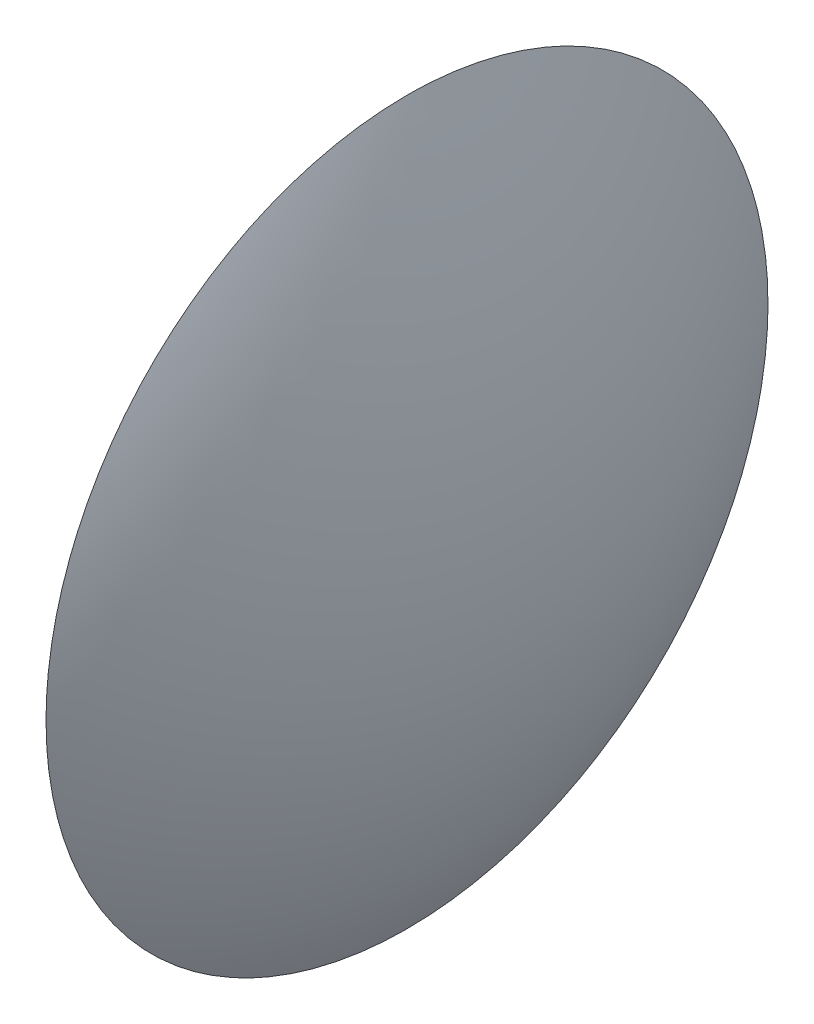
ISO-10303-21;
HEADER;
FILE_DESCRIPTION(('STEP AP214'),'2;1');
FILE_NAME('part.step','',(''),(''),'','','');
FILE_SCHEMA(('AUTOMOTIVE_DESIGN { 1 0 10303 214 1 1 1 1 }'));
ENDSEC;
DATA;
#1=APPLICATION_CONTEXT('core data for automotive mechanical design processes');
#2=APPLICATION_PROTOCOL_DEFINITION('international standard','automotive_design',2000,#1);
#3=PRODUCT_CONTEXT('',#1,'mechanical');
#4=PRODUCT('Part','Part','',(#3));
#5=PRODUCT_RELATED_PRODUCT_CATEGORY('part','',(#4));
#6=PRODUCT_DEFINITION_FORMATION('','',#4);
#7=PRODUCT_DEFINITION_CONTEXT('part definition',#1,'design');
#8=PRODUCT_DEFINITION('design','',#6,#7);
#9=PRODUCT_DEFINITION_SHAPE('','',#8);
#10=(LENGTH_UNIT() NAMED_UNIT(*) SI_UNIT(.MILLI.,.METRE.));
#11=(NAMED_UNIT(*) PLANE_ANGLE_UNIT() SI_UNIT($,.RADIAN.));
#12=(NAMED_UNIT(*) SI_UNIT($,.STERADIAN.) SOLID_ANGLE_UNIT());
#13=UNCERTAINTY_MEASURE_WITH_UNIT(LENGTH_MEASURE(1.E-05),#10,'distance_accuracy_value','');
#14=(GEOMETRIC_REPRESENTATION_CONTEXT(3) GLOBAL_UNCERTAINTY_ASSIGNED_CONTEXT((#13)) GLOBAL_UNIT_ASSIGNED_CONTEXT((#10,
#11,#12)) REPRESENTATION_CONTEXT('',''));
#15=CARTESIAN_POINT('',(0.,0.,0.));
#16=DIRECTION('',(0.,0.,1.));
#17=DIRECTION('',(1.,0.,0.));
#18=AXIS2_PLACEMENT_3D('',#15,#16,#17);
#19=CARTESIAN_POINT('',(-7.605,0.,0.));
#20=DIRECTION('',(0.,1.,0.));
#21=DIRECTION('',(1.,0.,0.));
#22=AXIS2_PLACEMENT_3D('',#19,#20,#21);
#23=SPHERICAL_SURFACE('',#22,8.105);
#24=CARTESIAN_POINT('',(-0.500000000000001,3.9,0.));
#25=CARTESIAN_POINT('',(-0.500000000000001,3.89999934380366,0.10949976959383));
#26=CARTESIAN_POINT('',(-0.5,3.89538426174637,0.219019662728201));
#27=CARTESIAN_POINT('',(-0.5,3.87695393805573,0.437302599534702));
#28=CARTESIAN_POINT('',(-0.5,3.86313598024706,0.546065410179308));
#29=CARTESIAN_POINT('',(-0.5,3.82636207253523,0.762223435763138));
#30=CARTESIAN_POINT('',(-0.5,3.8033916171118,0.869616199180522));
#31=CARTESIAN_POINT('',(-0.5,3.74847105342892,1.08214460574698));
#32=CARTESIAN_POINT('',(-0.499999999999999,3.71651365812307,1.18727834239227));
#33=CARTESIAN_POINT('',(-0.499999999999999,3.60760289078213,1.49771467333462));
#34=CARTESIAN_POINT('',(-0.5,3.5175214797461,1.69857482676057));
#35=CARTESIAN_POINT('',(-0.5,3.30486792570327,2.08229845867701));
#36=CARTESIAN_POINT('',(-0.499999999999999,3.18229454758581,2.26516125267505));
#37=CARTESIAN_POINT('',(-0.5,2.97685602704273,2.521984455763));
#38=CARTESIAN_POINT('',(-0.5,2.90472587177089,2.60472873819307));
#39=CARTESIAN_POINT('',(-0.5,2.75380831957002,2.76378975787012));
#40=CARTESIAN_POINT('',(-0.5,2.67502740827585,2.84011261532078));
#41=CARTESIAN_POINT('',(-0.5,2.51127831115569,2.98588369313582));
#42=CARTESIAN_POINT('',(-0.5,2.42630733871217,3.05532878368569));
#43=CARTESIAN_POINT('',(-0.5,2.25082498270572,3.18682094669305));
#44=CARTESIAN_POINT('',(-0.499999999999998,2.16031232047905,3.24886630196055));
#45=CARTESIAN_POINT('',(-0.499999999999997,1.88144874299347,3.42316887207192));
#46=CARTESIAN_POINT('',(-0.5,1.68559918568371,3.52374635861949));
#47=CARTESIAN_POINT('',(-0.5,1.27989991732141,3.69053219634282));
#48=CARTESIAN_POINT('',(-0.499999999999997,1.07005035582247,3.75674091459308));
#49=CARTESIAN_POINT('',(-0.499999999999997,0.642187186405351,3.85300563826267));
#50=CARTESIAN_POINT('',(-0.499999999999998,0.424173534893879,3.88306145061013));
#51=CARTESIAN_POINT('',(-0.500000000000001,-0.0138050382778963,3.90613604958109));
#52=CARTESIAN_POINT('',(-0.500000000000003,-0.233769959938199,3.89915483620459));
#53=CARTESIAN_POINT('',(-0.500000000000002,-0.669379723447521,3.84838158830577));
#54=CARTESIAN_POINT('',(-0.5,-0.885024588361101,3.80458975036713));
#55=CARTESIAN_POINT('',(-0.5,-1.30600329273566,3.68135687132141));
#56=CARTESIAN_POINT('',(-0.500000000000001,-1.51133702204203,3.60191544945727));
#57=CARTESIAN_POINT('',(-0.5,-1.80697202160344,3.45787994053739));
#58=CARTESIAN_POINT('',(-0.5,-1.90350315172273,3.40568885843017));
#59=CARTESIAN_POINT('',(-0.5,-2.09183085103507,3.29336377719873));
#60=CARTESIAN_POINT('',(-0.5,-2.18362851137617,3.23323162011639));
#61=CARTESIAN_POINT('',(-0.5,-2.36178829106494,3.10547377559686));
#62=CARTESIAN_POINT('',(-0.5,-2.44815285273226,3.03785149345713));
#63=CARTESIAN_POINT('',(-0.499999999999999,-2.61494858849887,2.89552897916975));
#64=CARTESIAN_POINT('',(-0.499999999999999,-2.69537395595959,2.82082197920847));
#65=CARTESIAN_POINT('',(-0.499999999999998,-2.92666139053759,2.58700738177364));
#66=CARTESIAN_POINT('',(-0.5,-3.06777088114531,2.41803653780248));
#67=CARTESIAN_POINT('',(-0.5,-3.31956771935379,2.05878215438259));
#68=CARTESIAN_POINT('',(-0.499999999999998,-3.43025622330335,1.8684994254187));
#69=CARTESIAN_POINT('',(-0.499999999999998,-3.57118377812841,1.57122565411896));
#70=CARTESIAN_POINT('',(-0.499999999999999,-3.61401139419376,1.47003191420441));
#71=CARTESIAN_POINT('',(-0.5,-3.69095976260918,1.26445093135062));
#72=CARTESIAN_POINT('',(-0.5,-3.72508756133561,1.16006635006167));
#73=CARTESIAN_POINT('',(-0.499999999999999,-3.78437112133658,0.948969045895296));
#74=CARTESIAN_POINT('',(-0.499999999999999,-3.8095410502317,0.842260285164365));
#75=CARTESIAN_POINT('',(-0.500000000000001,-3.85080585381562,0.627122344955314));
#76=CARTESIAN_POINT('',(-0.500000000000004,-3.86690340515741,0.518693682622155));
#77=CARTESIAN_POINT('',(-0.500000000000002,-3.88560095019215,0.341747470719371));
#78=CARTESIAN_POINT('',(-0.500000000000001,-3.89099888512164,0.273513224551251));
#79=CARTESIAN_POINT('',(-0.499999999999999,-3.89819861506958,0.136855272064732));
#80=CARTESIAN_POINT('',(-0.499999999999999,-3.90000041008802,0.0684315657463347));
#81=CARTESIAN_POINT('',(-0.5,-3.89999934380366,-0.109499769593829));
#82=CARTESIAN_POINT('',(-0.5,-3.89538426174637,-0.219019662728201));
#83=CARTESIAN_POINT('',(-0.5,-3.87695393805573,-0.437302599534701));
#84=CARTESIAN_POINT('',(-0.5,-3.86313598024706,-0.546065410179307));
#85=CARTESIAN_POINT('',(-0.5,-3.82636207253523,-0.762223435763137));
#86=CARTESIAN_POINT('',(-0.499999999999999,-3.8033916171118,-0.86961619918052));
#87=CARTESIAN_POINT('',(-0.5,-3.74847105342892,-1.08214460574698));
#88=CARTESIAN_POINT('',(-0.500000000000001,-3.71651365812307,-1.18727834239227));
#89=CARTESIAN_POINT('',(-0.500000000000002,-3.60760289078214,-1.49771467333462));
#90=CARTESIAN_POINT('',(-0.5,-3.51752147974611,-1.69857482676057));
#91=CARTESIAN_POINT('',(-0.5,-3.30486792570327,-2.08229845867701));
#92=CARTESIAN_POINT('',(-0.500000000000002,-3.18229454758581,-2.26516125267505));
#93=CARTESIAN_POINT('',(-0.500000000000001,-2.97685602704274,-2.521984455763));
#94=CARTESIAN_POINT('',(-0.5,-2.90472587177089,-2.60472873819307));
#95=CARTESIAN_POINT('',(-0.499999999999999,-2.75380831957002,-2.76378975787011));
#96=CARTESIAN_POINT('',(-0.5,-2.67502740827585,-2.84011261532078));
#97=CARTESIAN_POINT('',(-0.5,-2.51127831115569,-2.98588369313582));
#98=CARTESIAN_POINT('',(-0.5,-2.42630733871218,-3.05532878368569));
#99=CARTESIAN_POINT('',(-0.5,-2.25082498270572,-3.18682094669305));
#100=CARTESIAN_POINT('',(-0.5,-2.16031232047906,-3.24886630196055));
#101=CARTESIAN_POINT('',(-0.5,-1.88144874299347,-3.42316887207192));
#102=CARTESIAN_POINT('',(-0.500000000000001,-1.68559918568372,-3.52374635861949));
#103=CARTESIAN_POINT('',(-0.499999999999999,-1.27989991732141,-3.69053219634282));
#104=CARTESIAN_POINT('',(-0.499999999999997,-1.07005035582247,-3.75674091459308));
#105=CARTESIAN_POINT('',(-0.499999999999997,-0.642187186405355,-3.85300563826267));
#106=CARTESIAN_POINT('',(-0.499999999999999,-0.424173534893883,-3.88306145061013));
#107=CARTESIAN_POINT('',(-0.5,0.0138050382778912,-3.90613604958109));
#108=CARTESIAN_POINT('',(-0.499999999999999,0.233769959938194,-3.89915483620459));
#109=CARTESIAN_POINT('',(-0.499999999999999,0.669379723447516,-3.84838158830576));
#110=CARTESIAN_POINT('',(-0.499999999999999,0.885024588361096,-3.80458975036713));
#111=CARTESIAN_POINT('',(-0.5,1.30600329273566,-3.68135687132141));
#112=CARTESIAN_POINT('',(-0.500000000000001,1.51133702204202,-3.60191544945727));
#113=CARTESIAN_POINT('',(-0.5,1.80697202160343,-3.45787994053739));
#114=CARTESIAN_POINT('',(-0.5,1.90350315172273,-3.40568885843018));
#115=CARTESIAN_POINT('',(-0.5,2.09183085103507,-3.29336377719874));
#116=CARTESIAN_POINT('',(-0.5,2.18362851137617,-3.23323162011639));
#117=CARTESIAN_POINT('',(-0.5,2.36178829106494,-3.10547377559686));
#118=CARTESIAN_POINT('',(-0.5,2.44815285273226,-3.03785149345713));
#119=CARTESIAN_POINT('',(-0.5,2.61494858849886,-2.89552897916975));
#120=CARTESIAN_POINT('',(-0.500000000000001,2.69537395595959,-2.82082197920848));
#121=CARTESIAN_POINT('',(-0.500000000000002,2.92666139053759,-2.58700738177364));
#122=CARTESIAN_POINT('',(-0.500000000000001,3.0677708811453,-2.41803653780249));
#123=CARTESIAN_POINT('',(-0.499999999999999,3.31956771935378,-2.0587821543826));
#124=CARTESIAN_POINT('',(-0.499999999999999,3.43025622330335,-1.86849942541871));
#125=CARTESIAN_POINT('',(-0.5,3.57118377812841,-1.57122565411897));
#126=CARTESIAN_POINT('',(-0.5,3.61401139419376,-1.47003191420441));
#127=CARTESIAN_POINT('',(-0.5,3.69095976260918,-1.26445093135063));
#128=CARTESIAN_POINT('',(-0.5,3.72508756133561,-1.16006635006167));
#129=CARTESIAN_POINT('',(-0.5,3.78437112133658,-0.948969045895302));
#130=CARTESIAN_POINT('',(-0.5,3.8095410502317,-0.842260285164372));
#131=CARTESIAN_POINT('',(-0.5,3.85080585381562,-0.627122344955321));
#132=CARTESIAN_POINT('',(-0.499999999999999,3.86690340515741,-0.518693682622162));
#133=CARTESIAN_POINT('',(-0.499999999999999,3.88560095019214,-0.341747470719377));
#134=CARTESIAN_POINT('',(-0.5,3.89099888512164,-0.273513224551255));
#135=CARTESIAN_POINT('',(-0.5,3.89819861506958,-0.136855272064735));
#136=CARTESIAN_POINT('',(-0.500000000000001,3.90000041008801,-0.068431565746336));
#137=CARTESIAN_POINT('',(-0.500000000000001,3.9,0.));
#138=B_SPLINE_CURVE_WITH_KNOTS('',3,(#24,#25,#26,#27,#28,#29,#30,#31,#32,#33,#34,#35,#36,#37,
#38,#39,#40,#41,#42,#43,#44,#45,#46,#47,#48,#49,#50,#51,#52,#53,#54,#55,#56,#57,#58,#59,#60,#61,
#62,#63,#64,#65,#66,#67,#68,#69,#70,#71,#72,#73,#74,#75,#76,#77,#78,#79,#80,#81,#82,#83,#84,#85,
#86,#87,#88,#89,#90,#91,#92,#93,#94,#95,#96,#97,#98,#99,#100,#101,#102,#103,#104,#105,#106,#107,
#108,#109,#110,#111,#112,#113,#114,#115,#116,#117,#118,#119,#120,#121,#122,#123,#124,#125,#126,
#127,#128,#129,#130,#131,#132,#133,#134,#135,#136,#137),.UNSPECIFIED.,.T.,.F.,(4,2,2,2,2,2,2,2,
2,2,2,2,2,2,2,2,2,2,2,2,2,2,2,2,2,2,2,2,2,2,2,2,2,2,2,2,2,2,2,2,2,2,2,2,2,2,2,2,2,2,2,2,2,2,2,2,
4),(0.,0.328436311039314,0.656969601130914,0.986025658205005,1.31534930303756,1.9724267457949,
2.62952916948836,2.95851090616312,3.28717545489399,3.61598888590932,3.94487847383524,
4.60197191616618,5.2590583402876,5.91614827351385,6.5732382067401,7.23032463086152,
7.88741807319246,8.21630766111838,8.54512109213371,8.87378564086458,9.20276737753934,
9.85986980123279,10.5169472439901,10.8462708888227,11.1753269458968,11.5038602359884,
11.8322965470277,12.0375518740091,12.2428072009905,12.5712435120298,12.8997768021214,
13.2288328591955,13.5581565040281,14.2152339467854,14.8723363704789,15.2013181071536,
15.5299826558845,15.8587960868998,16.1876856748258,16.8447791171567,17.5018655412781,
18.1589554745044,18.8160454077306,19.473131831852,20.130225274183,20.4591148621089,
20.7879282931242,21.1165928418551,21.4455745785299,22.1026770022233,22.7597544449807,
23.0890780898132,23.4181341468873,23.7466674369789,24.0751037480182,24.2803590749996,
24.485614401981),.UNSPECIFIED.);
#139=CARTESIAN_POINT('',(-0.500000000000001,3.9,0.));
#140=VERTEX_POINT('',#139);
#141=EDGE_CURVE('E10',#140,#140,#138,.T.);
#142=ORIENTED_EDGE('',*,*,#141,.T.);
#143=EDGE_LOOP('',(#142));
#144=FACE_BOUND('',#143,.T.);
#145=ADVANCED_FACE('F15',(#144),#23,.T.);
#146=CARTESIAN_POINT('',(-0.5,0.,0.));
#147=DIRECTION('',(1.,0.,0.));
#148=DIRECTION('',(0.,1.,0.));
#149=AXIS2_PLACEMENT_3D('',#146,#147,#148);
#150=PLANE('',#149);
#151=ORIENTED_EDGE('',*,*,#141,.F.);
#152=EDGE_LOOP('',(#151));
#153=FACE_BOUND('',#152,.T.);
#154=ADVANCED_FACE('F27',(#153),#150,.F.);
#155=CLOSED_SHELL('',(#145,#154));
#156=MANIFOLD_SOLID_BREP('B1',#155);
#157=ADVANCED_BREP_SHAPE_REPRESENTATION('',(#18,#156),#14);
#158=SHAPE_DEFINITION_REPRESENTATION(#9,#157);
ENDSEC;
END-ISO-10303-21;
